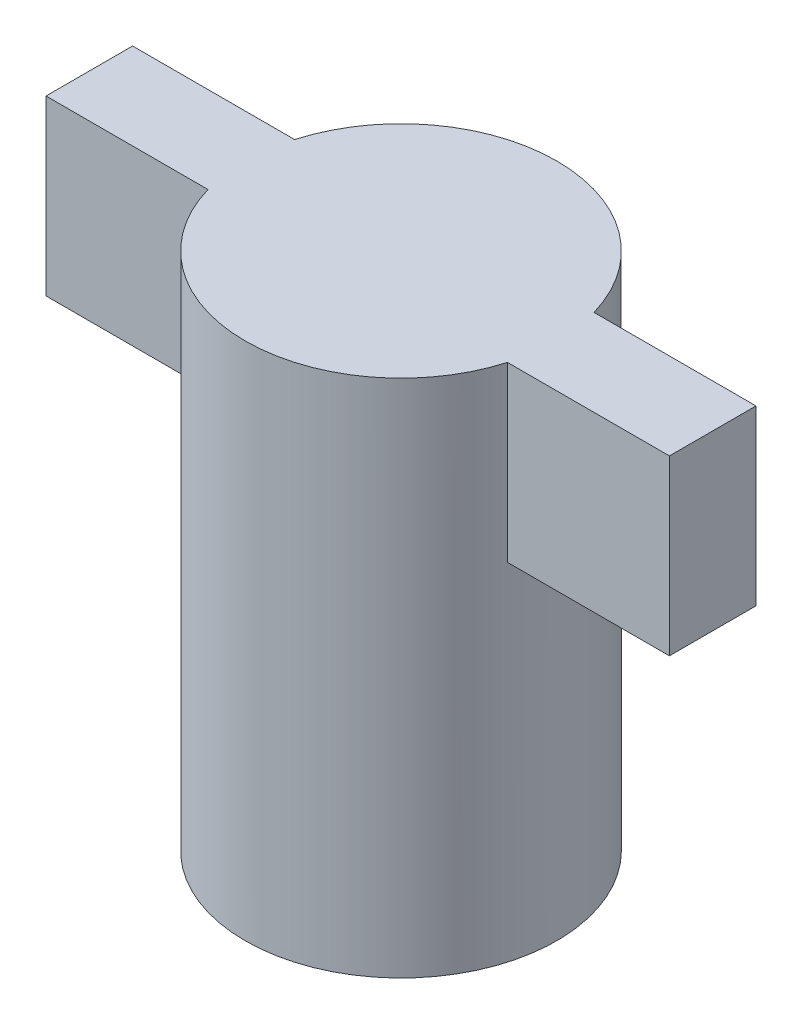
ISO-10303-21;
HEADER;
FILE_DESCRIPTION(('STEP AP214'),'2;1');
FILE_NAME('part.step','',(''),(''),'','','');
FILE_SCHEMA(('AUTOMOTIVE_DESIGN { 1 0 10303 214 1 1 1 1 }'));
ENDSEC;
DATA;
#1=APPLICATION_CONTEXT('core data for automotive mechanical design processes');
#2=APPLICATION_PROTOCOL_DEFINITION('international standard','automotive_design',2000,#1);
#3=PRODUCT_CONTEXT('',#1,'mechanical');
#4=PRODUCT('Part','Part','',(#3));
#5=PRODUCT_RELATED_PRODUCT_CATEGORY('part','',(#4));
#6=PRODUCT_DEFINITION_FORMATION('','',#4);
#7=PRODUCT_DEFINITION_CONTEXT('part definition',#1,'design');
#8=PRODUCT_DEFINITION('design','',#6,#7);
#9=PRODUCT_DEFINITION_SHAPE('','',#8);
#10=(LENGTH_UNIT() NAMED_UNIT(*) SI_UNIT(.MILLI.,.METRE.));
#11=(NAMED_UNIT(*) PLANE_ANGLE_UNIT() SI_UNIT($,.RADIAN.));
#12=(NAMED_UNIT(*) SI_UNIT($,.STERADIAN.) SOLID_ANGLE_UNIT());
#13=UNCERTAINTY_MEASURE_WITH_UNIT(LENGTH_MEASURE(1.E-05),#10,'distance_accuracy_value','');
#14=(GEOMETRIC_REPRESENTATION_CONTEXT(3) GLOBAL_UNCERTAINTY_ASSIGNED_CONTEXT((#13)) GLOBAL_UNIT_ASSIGNED_CONTEXT((#10,
#11,#12)) REPRESENTATION_CONTEXT('',''));
#15=CARTESIAN_POINT('',(0.,0.,0.));
#16=DIRECTION('',(0.,0.,1.));
#17=DIRECTION('',(1.,0.,0.));
#18=AXIS2_PLACEMENT_3D('',#15,#16,#17);
#19=CARTESIAN_POINT('',(0.,15.,0.));
#20=DIRECTION('',(0.,-1.,0.));
#21=DIRECTION('',(0.,0.,-1.));
#22=AXIS2_PLACEMENT_3D('',#19,#20,#21);
#23=CYLINDRICAL_SURFACE('',#22,4.5);
#24=CARTESIAN_POINT('',(0.,10.,0.));
#25=DIRECTION('',(0.,1.,0.));
#26=DIRECTION('',(0.,0.,1.));
#27=AXIS2_PLACEMENT_3D('',#24,#25,#26);
#28=CIRCLE('',#27,4.5);
#29=CARTESIAN_POINT('',(4.32290411644765,10.,1.25));
#30=VERTEX_POINT('',#29);
#31=CARTESIAN_POINT('',(4.32290411644765,10.,-1.25));
#32=VERTEX_POINT('',#31);
#33=EDGE_CURVE('E11',#30,#32,#28,.T.);
#34=ORIENTED_EDGE('',*,*,#33,.F.);
#35=DIRECTION('',(0.,-1.,0.));
#36=VECTOR('',#35,1.);
#37=CARTESIAN_POINT('',(4.32290411644765,15.,1.25));
#38=LINE('',#37,#36);
#39=CARTESIAN_POINT('',(4.32290411644765,15.,1.25));
#40=VERTEX_POINT('',#39);
#41=EDGE_CURVE('E199',#30,#40,#38,.F.);
#42=ORIENTED_EDGE('',*,*,#41,.T.);
#43=CARTESIAN_POINT('',(0.,15.,0.));
#44=DIRECTION('',(0.,1.,0.));
#45=DIRECTION('',(0.,0.,1.));
#46=AXIS2_PLACEMENT_3D('',#43,#44,#45);
#47=CIRCLE('',#46,4.5);
#48=CARTESIAN_POINT('',(-4.32290411644765,15.,1.25));
#49=VERTEX_POINT('',#48);
#50=EDGE_CURVE('E270',#49,#40,#47,.T.);
#51=ORIENTED_EDGE('',*,*,#50,.F.);
#52=DIRECTION('',(0.,-1.,0.));
#53=VECTOR('',#52,1.);
#54=CARTESIAN_POINT('',(-4.32290411644765,15.,1.25));
#55=LINE('',#54,#53);
#56=CARTESIAN_POINT('',(-4.32290411644765,10.,1.25));
#57=VERTEX_POINT('',#56);
#58=EDGE_CURVE('E203',#49,#57,#55,.T.);
#59=ORIENTED_EDGE('',*,*,#58,.T.);
#60=CARTESIAN_POINT('',(-4.32290411644765,10.,-1.25));
#61=VERTEX_POINT('',#60);
#62=EDGE_CURVE('E42',#61,#57,#28,.T.);
#63=ORIENTED_EDGE('',*,*,#62,.F.);
#64=DIRECTION('',(0.,-1.,0.));
#65=VECTOR('',#64,1.);
#66=CARTESIAN_POINT('',(-4.32290411644765,15.,-1.25));
#67=LINE('',#66,#65);
#68=CARTESIAN_POINT('',(-4.32290411644765,15.,-1.25));
#69=VERTEX_POINT('',#68);
#70=EDGE_CURVE('E186',#61,#69,#67,.F.);
#71=ORIENTED_EDGE('',*,*,#70,.T.);
#72=CARTESIAN_POINT('',(4.32290411644765,15.,-1.25));
#73=VERTEX_POINT('',#72);
#74=EDGE_CURVE('E272',#73,#69,#47,.T.);
#75=ORIENTED_EDGE('',*,*,#74,.F.);
#76=DIRECTION('',(0.,-1.,0.));
#77=VECTOR('',#76,1.);
#78=CARTESIAN_POINT('',(4.32290411644765,15.,-1.25));
#79=LINE('',#78,#77);
#80=EDGE_CURVE('E196',#73,#32,#79,.T.);
#81=ORIENTED_EDGE('',*,*,#80,.T.);
#82=EDGE_LOOP('',(#34,#42,#51,#59,#63,#71,#75,#81));
#83=FACE_BOUND('',#82,.T.);
#84=CARTESIAN_POINT('',(0.,0.,0.));
#85=DIRECTION('',(0.,1.,0.));
#86=DIRECTION('',(0.,0.,1.));
#87=AXIS2_PLACEMENT_3D('',#84,#85,#86);
#88=CIRCLE('',#87,4.5);
#89=CARTESIAN_POINT('',(0.,0.,4.5));
#90=VERTEX_POINT('',#89);
#91=EDGE_CURVE('E266',#90,#90,#88,.T.);
#92=ORIENTED_EDGE('',*,*,#91,.T.);
#93=EDGE_LOOP('',(#92));
#94=FACE_BOUND('',#93,.T.);
#95=ADVANCED_FACE('F39',(#83,#94),#23,.T.);
#96=CARTESIAN_POINT('',(0.,15.,0.));
#97=DIRECTION('',(0.,1.,0.));
#98=DIRECTION('',(0.,0.,1.));
#99=AXIS2_PLACEMENT_3D('',#96,#97,#98);
#100=PLANE('',#99);
#101=ORIENTED_EDGE('',*,*,#74,.T.);
#102=DIRECTION('',(-1.,0.,0.));
#103=VECTOR('',#102,1.);
#104=CARTESIAN_POINT('',(-9.,15.,-1.25));
#105=LINE('',#104,#103);
#106=CARTESIAN_POINT('',(-9.,15.,-1.25));
#107=VERTEX_POINT('',#106);
#108=EDGE_CURVE('E178',#69,#107,#105,.T.);
#109=ORIENTED_EDGE('',*,*,#108,.T.);
#110=DIRECTION('',(0.,0.,1.));
#111=VECTOR('',#110,1.);
#112=CARTESIAN_POINT('',(-9.,15.,-1.25));
#113=LINE('',#112,#111);
#114=CARTESIAN_POINT('',(-9.,15.,1.25));
#115=VERTEX_POINT('',#114);
#116=EDGE_CURVE('E181',#107,#115,#113,.T.);
#117=ORIENTED_EDGE('',*,*,#116,.T.);
#118=DIRECTION('',(1.,0.,0.));
#119=VECTOR('',#118,1.);
#120=CARTESIAN_POINT('',(-9.,15.,1.25));
#121=LINE('',#120,#119);
#122=EDGE_CURVE('E54',#115,#49,#121,.T.);
#123=ORIENTED_EDGE('',*,*,#122,.T.);
#124=ORIENTED_EDGE('',*,*,#50,.T.);
#125=CARTESIAN_POINT('',(9.,15.,1.25));
#126=VERTEX_POINT('',#125);
#127=EDGE_CURVE('E165',#40,#126,#121,.T.);
#128=ORIENTED_EDGE('',*,*,#127,.T.);
#129=DIRECTION('',(0.,0.,-1.));
#130=VECTOR('',#129,1.);
#131=CARTESIAN_POINT('',(9.,15.,-1.25));
#132=LINE('',#131,#130);
#133=CARTESIAN_POINT('',(9.,15.,-1.25));
#134=VERTEX_POINT('',#133);
#135=EDGE_CURVE('E175',#126,#134,#132,.T.);
#136=ORIENTED_EDGE('',*,*,#135,.T.);
#137=EDGE_CURVE('E61',#134,#73,#105,.T.);
#138=ORIENTED_EDGE('',*,*,#137,.T.);
#139=EDGE_LOOP('',(#101,#109,#117,#123,#124,#128,#136,#138));
#140=FACE_BOUND('',#139,.T.);
#141=ADVANCED_FACE('F281',(#140),#100,.T.);
#142=CARTESIAN_POINT('',(0.,0.,0.));
#143=DIRECTION('',(0.,1.,0.));
#144=DIRECTION('',(0.,0.,1.));
#145=AXIS2_PLACEMENT_3D('',#142,#143,#144);
#146=PLANE('',#145);
#147=CARTESIAN_POINT('',(0.,0.,0.00920047577960409));
#148=DIRECTION('',(0.,-1.,0.));
#149=DIRECTION('',(0.,0.,-1.));
#150=AXIS2_PLACEMENT_3D('',#147,#148,#149);
#151=CIRCLE('',#150,4.);
#152=CARTESIAN_POINT('',(0.,0.,-3.9907995242204));
#153=VERTEX_POINT('',#152);
#154=EDGE_CURVE('E257',#153,#153,#151,.T.);
#155=ORIENTED_EDGE('',*,*,#154,.F.);
#156=EDGE_LOOP('',(#155));
#157=FACE_BOUND('',#156,.T.);
#158=ORIENTED_EDGE('',*,*,#91,.F.);
#159=EDGE_LOOP('',(#158));
#160=FACE_BOUND('',#159,.T.);
#161=ADVANCED_FACE('F278',(#157,#160),#146,.F.);
#162=CARTESIAN_POINT('',(0.,1.5,0.00920047577960409));
#163=DIRECTION('',(0.,-1.,0.));
#164=DIRECTION('',(0.,0.,-1.));
#165=AXIS2_PLACEMENT_3D('',#162,#163,#164);
#166=CYLINDRICAL_SURFACE('',#165,4.);
#167=CARTESIAN_POINT('',(0.,1.5,0.00920047577960409));
#168=DIRECTION('',(0.,-1.,0.));
#169=DIRECTION('',(0.,0.,-1.));
#170=AXIS2_PLACEMENT_3D('',#167,#168,#169);
#171=CIRCLE('',#170,4.);
#172=CARTESIAN_POINT('',(0.,1.5,-3.9907995242204));
#173=VERTEX_POINT('',#172);
#174=EDGE_CURVE('E262',#173,#173,#171,.T.);
#175=ORIENTED_EDGE('',*,*,#174,.F.);
#176=EDGE_LOOP('',(#175));
#177=FACE_BOUND('',#176,.T.);
#178=ORIENTED_EDGE('',*,*,#154,.T.);
#179=EDGE_LOOP('',(#178));
#180=FACE_BOUND('',#179,.T.);
#181=ADVANCED_FACE('F280',(#177,#180),#166,.F.);
#182=CARTESIAN_POINT('',(0.,1.5,0.00920047577960409));
#183=DIRECTION('',(0.,-1.,0.));
#184=DIRECTION('',(0.,0.,-1.));
#185=AXIS2_PLACEMENT_3D('',#182,#183,#184);
#186=PLANE('',#185);
#187=CARTESIAN_POINT('',(0.00613365051973548,1.5,-0.00920047577960409));
#188=DIRECTION('',(0.,-1.,0.));
#189=DIRECTION('',(0.,0.,-1.));
#190=AXIS2_PLACEMENT_3D('',#187,#188,#189);
#191=CIRCLE('',#190,3.);
#192=CARTESIAN_POINT('',(0.00613365051973548,1.5,-3.0092004757796));
#193=VERTEX_POINT('',#192);
#194=EDGE_CURVE('E243',#193,#193,#191,.T.);
#195=ORIENTED_EDGE('',*,*,#194,.F.);
#196=EDGE_LOOP('',(#195));
#197=FACE_BOUND('',#196,.T.);
#198=ORIENTED_EDGE('',*,*,#174,.T.);
#199=EDGE_LOOP('',(#198));
#200=FACE_BOUND('',#199,.T.);
#201=ADVANCED_FACE('F287',(#197,#200),#186,.T.);
#202=CARTESIAN_POINT('',(0.00613365051973548,4.,-0.00920047577960409));
#203=DIRECTION('',(0.,-1.,0.));
#204=DIRECTION('',(0.,0.,-1.));
#205=AXIS2_PLACEMENT_3D('',#202,#203,#204);
#206=CYLINDRICAL_SURFACE('',#205,3.);
#207=CARTESIAN_POINT('',(0.00613365051973548,4.,-0.00920047577960409));
#208=DIRECTION('',(0.,-1.,0.));
#209=DIRECTION('',(0.,0.,-1.));
#210=AXIS2_PLACEMENT_3D('',#207,#208,#209);
#211=CIRCLE('',#210,3.);
#212=CARTESIAN_POINT('',(-2.43075951008928,4.,1.7405285671802));
#213=VERTEX_POINT('',#212);
#214=CARTESIAN_POINT('',(-2.44461366718219,4.,-1.7394714328198));
#215=VERTEX_POINT('',#214);
#216=EDGE_CURVE('E253',#213,#215,#211,.T.);
#217=ORIENTED_EDGE('',*,*,#216,.F.);
#218=EDGE_CURVE('E258',#215,#213,#211,.T.);
#219=ORIENTED_EDGE('',*,*,#218,.F.);
#220=EDGE_LOOP('',(#217,#219));
#221=FACE_BOUND('',#220,.T.);
#222=ORIENTED_EDGE('',*,*,#194,.T.);
#223=EDGE_LOOP('',(#222));
#224=FACE_BOUND('',#223,.T.);
#225=ADVANCED_FACE('F325',(#221,#224),#206,.F.);
#226=CARTESIAN_POINT('',(0.00613365051973548,4.,-0.00920047577960409));
#227=DIRECTION('',(0.,-1.,0.));
#228=DIRECTION('',(0.,0.,-1.));
#229=AXIS2_PLACEMENT_3D('',#226,#227,#228);
#230=PLANE('',#229);
#231=DIRECTION('',(-1.,0.,0.));
#232=VECTOR('',#231,1.);
#233=CARTESIAN_POINT('',(-2.44618852665088,4.,1.7405285671802));
#234=LINE('',#233,#232);
#235=CARTESIAN_POINT('',(2.44151031840903,4.,1.7405285671802));
#236=VERTEX_POINT('',#235);
#237=EDGE_CURVE('E228',#236,#213,#234,.T.);
#238=ORIENTED_EDGE('',*,*,#237,.F.);
#239=CARTESIAN_POINT('',(-0.00233910412092181,4.,0.000528567180196979));
#240=DIRECTION('',(0.,-1.,0.));
#241=DIRECTION('',(0.,0.,1.));
#242=AXIS2_PLACEMENT_3D('',#239,#240,#241);
#243=CIRCLE('',#242,3.);
#244=CARTESIAN_POINT('',(2.44151031840904,4.,-1.7394714328198));
#245=VERTEX_POINT('',#244);
#246=EDGE_CURVE('E207',#245,#236,#243,.T.);
#247=ORIENTED_EDGE('',*,*,#246,.F.);
#248=DIRECTION('',(1.,0.,0.));
#249=VECTOR('',#248,1.);
#250=CARTESIAN_POINT('',(-2.44618852665088,4.,-1.7394714328198));
#251=LINE('',#250,#249);
#252=EDGE_CURVE('E238',#215,#245,#251,.T.);
#253=ORIENTED_EDGE('',*,*,#252,.F.);
#254=ORIENTED_EDGE('',*,*,#218,.T.);
#255=EDGE_LOOP('',(#238,#247,#253,#254));
#256=FACE_BOUND('',#255,.T.);
#257=ADVANCED_FACE('F322',(#256),#230,.T.);
#258=CARTESIAN_POINT('',(-0.00233910412092181,4.,0.000528567180196979));
#259=DIRECTION('',(0.,1.,0.));
#260=DIRECTION('',(0.,0.,1.));
#261=AXIS2_PLACEMENT_3D('',#258,#259,#260);
#262=PLANE('',#261);
#263=ORIENTED_EDGE('',*,*,#216,.T.);
#264=CARTESIAN_POINT('',(-2.44618852665088,4.,-1.7394714328198));
#265=VERTEX_POINT('',#264);
#266=EDGE_CURVE('E212',#265,#215,#251,.T.);
#267=ORIENTED_EDGE('',*,*,#266,.F.);
#268=CARTESIAN_POINT('',(-0.00233910412092181,4.,0.000528567180196979));
#269=DIRECTION('',(0.,-1.,0.));
#270=DIRECTION('',(0.,0.,-1.));
#271=AXIS2_PLACEMENT_3D('',#268,#269,#270);
#272=CIRCLE('',#271,3.);
#273=CARTESIAN_POINT('',(-2.44618852665088,4.,1.7405285671802));
#274=VERTEX_POINT('',#273);
#275=EDGE_CURVE('E232',#274,#265,#272,.T.);
#276=ORIENTED_EDGE('',*,*,#275,.F.);
#277=EDGE_CURVE('E227',#213,#274,#234,.T.);
#278=ORIENTED_EDGE('',*,*,#277,.F.);
#279=EDGE_LOOP('',(#263,#267,#276,#278));
#280=FACE_BOUND('',#279,.T.);
#281=ADVANCED_FACE('F329',(#280),#262,.T.);
#282=CARTESIAN_POINT('',(-0.00233910412092181,10.,0.000528567180196979));
#283=DIRECTION('',(0.,-1.,0.));
#284=DIRECTION('',(0.,0.,-1.));
#285=AXIS2_PLACEMENT_3D('',#282,#283,#284);
#286=CYLINDRICAL_SURFACE('',#285,3.);
#287=ORIENTED_EDGE('',*,*,#246,.T.);
#288=DIRECTION('',(0.,-1.,0.));
#289=VECTOR('',#288,1.);
#290=CARTESIAN_POINT('',(2.44151031840903,10.,1.7405285671802));
#291=LINE('',#290,#289);
#292=CARTESIAN_POINT('',(2.44151031840903,10.,1.7405285671802));
#293=VERTEX_POINT('',#292);
#294=EDGE_CURVE('E223',#293,#236,#291,.T.);
#295=ORIENTED_EDGE('',*,*,#294,.F.);
#296=CARTESIAN_POINT('',(-0.00233910412092181,10.,0.000528567180196979));
#297=DIRECTION('',(0.,-1.,0.));
#298=DIRECTION('',(0.,0.,1.));
#299=AXIS2_PLACEMENT_3D('',#296,#297,#298);
#300=CIRCLE('',#299,3.);
#301=CARTESIAN_POINT('',(2.44151031840904,10.,-1.7394714328198));
#302=VERTEX_POINT('',#301);
#303=EDGE_CURVE('E208',#302,#293,#300,.T.);
#304=ORIENTED_EDGE('',*,*,#303,.F.);
#305=DIRECTION('',(0.,-1.,0.));
#306=VECTOR('',#305,1.);
#307=CARTESIAN_POINT('',(2.44151031840904,10.,-1.7394714328198));
#308=LINE('',#307,#306);
#309=EDGE_CURVE('E239',#302,#245,#308,.T.);
#310=ORIENTED_EDGE('',*,*,#309,.T.);
#311=EDGE_LOOP('',(#287,#295,#304,#310));
#312=FACE_BOUND('',#311,.T.);
#313=ADVANCED_FACE('F337',(#312),#286,.F.);
#314=CARTESIAN_POINT('',(-2.44618852665088,10.,-1.7394714328198));
#315=DIRECTION('',(0.,0.,-1.));
#316=DIRECTION('',(-1.,0.,0.));
#317=AXIS2_PLACEMENT_3D('',#314,#315,#316);
#318=PLANE('',#317);
#319=ORIENTED_EDGE('',*,*,#266,.T.);
#320=ORIENTED_EDGE('',*,*,#252,.T.);
#321=ORIENTED_EDGE('',*,*,#309,.F.);
#322=DIRECTION('',(1.,0.,0.));
#323=VECTOR('',#322,1.);
#324=CARTESIAN_POINT('',(-2.44618852665088,10.,-1.7394714328198));
#325=LINE('',#324,#323);
#326=CARTESIAN_POINT('',(-2.44618852665088,10.,-1.7394714328198));
#327=VERTEX_POINT('',#326);
#328=EDGE_CURVE('E219',#327,#302,#325,.T.);
#329=ORIENTED_EDGE('',*,*,#328,.F.);
#330=DIRECTION('',(0.,-1.,0.));
#331=VECTOR('',#330,1.);
#332=CARTESIAN_POINT('',(-2.44618852665088,10.,-1.7394714328198));
#333=LINE('',#332,#331);
#334=EDGE_CURVE('E244',#327,#265,#333,.T.);
#335=ORIENTED_EDGE('',*,*,#334,.T.);
#336=EDGE_LOOP('',(#319,#320,#321,#329,#335));
#337=FACE_BOUND('',#336,.T.);
#338=ADVANCED_FACE('F339',(#337),#318,.F.);
#339=CARTESIAN_POINT('',(-0.00233910412092181,10.,0.000528567180196979));
#340=DIRECTION('',(0.,-1.,0.));
#341=DIRECTION('',(0.,0.,-1.));
#342=AXIS2_PLACEMENT_3D('',#339,#340,#341);
#343=CYLINDRICAL_SURFACE('',#342,3.);
#344=ORIENTED_EDGE('',*,*,#275,.T.);
#345=ORIENTED_EDGE('',*,*,#334,.F.);
#346=CARTESIAN_POINT('',(-0.00233910412092181,10.,0.000528567180196979));
#347=DIRECTION('',(0.,-1.,0.));
#348=DIRECTION('',(0.,0.,-1.));
#349=AXIS2_PLACEMENT_3D('',#346,#347,#348);
#350=CIRCLE('',#349,3.);
#351=CARTESIAN_POINT('',(-2.44618852665088,10.,1.7405285671802));
#352=VERTEX_POINT('',#351);
#353=EDGE_CURVE('E216',#352,#327,#350,.T.);
#354=ORIENTED_EDGE('',*,*,#353,.F.);
#355=DIRECTION('',(0.,-1.,0.));
#356=VECTOR('',#355,1.);
#357=CARTESIAN_POINT('',(-2.44618852665088,10.,1.7405285671802));
#358=LINE('',#357,#356);
#359=EDGE_CURVE('E247',#352,#274,#358,.T.);
#360=ORIENTED_EDGE('',*,*,#359,.T.);
#361=EDGE_LOOP('',(#344,#345,#354,#360));
#362=FACE_BOUND('',#361,.T.);
#363=ADVANCED_FACE('F345',(#362),#343,.F.);
#364=CARTESIAN_POINT('',(-2.44618852665088,10.,1.7405285671802));
#365=DIRECTION('',(0.,0.,1.));
#366=DIRECTION('',(1.,0.,0.));
#367=AXIS2_PLACEMENT_3D('',#364,#365,#366);
#368=PLANE('',#367);
#369=ORIENTED_EDGE('',*,*,#237,.T.);
#370=ORIENTED_EDGE('',*,*,#277,.T.);
#371=ORIENTED_EDGE('',*,*,#359,.F.);
#372=DIRECTION('',(-1.,0.,0.));
#373=VECTOR('',#372,1.);
#374=CARTESIAN_POINT('',(-2.44618852665088,10.,1.7405285671802));
#375=LINE('',#374,#373);
#376=EDGE_CURVE('E211',#293,#352,#375,.T.);
#377=ORIENTED_EDGE('',*,*,#376,.F.);
#378=ORIENTED_EDGE('',*,*,#294,.T.);
#379=EDGE_LOOP('',(#369,#370,#371,#377,#378));
#380=FACE_BOUND('',#379,.T.);
#381=ADVANCED_FACE('F332',(#380),#368,.F.);
#382=CARTESIAN_POINT('',(-0.00233910412092181,10.,0.000528567180196979));
#383=DIRECTION('',(0.,1.,0.));
#384=DIRECTION('',(0.,0.,1.));
#385=AXIS2_PLACEMENT_3D('',#382,#383,#384);
#386=PLANE('',#385);
#387=ORIENTED_EDGE('',*,*,#303,.T.);
#388=ORIENTED_EDGE('',*,*,#376,.T.);
#389=ORIENTED_EDGE('',*,*,#353,.T.);
#390=ORIENTED_EDGE('',*,*,#328,.T.);
#391=EDGE_LOOP('',(#387,#388,#389,#390));
#392=FACE_BOUND('',#391,.T.);
#393=ADVANCED_FACE('F342',(#392),#386,.F.);
#394=CARTESIAN_POINT('',(-9.,10.,-1.25));
#395=DIRECTION('',(-1.,0.,0.));
#396=DIRECTION('',(0.,0.,1.));
#397=AXIS2_PLACEMENT_3D('',#394,#395,#396);
#398=PLANE('',#397);
#399=ORIENTED_EDGE('',*,*,#116,.F.);
#400=DIRECTION('',(0.,1.,0.));
#401=VECTOR('',#400,1.);
#402=CARTESIAN_POINT('',(-9.,10.,-1.25));
#403=LINE('',#402,#401);
#404=CARTESIAN_POINT('',(-9.,10.,-1.25));
#405=VERTEX_POINT('',#404);
#406=EDGE_CURVE('E144',#405,#107,#403,.T.);
#407=ORIENTED_EDGE('',*,*,#406,.F.);
#408=DIRECTION('',(0.,0.,1.));
#409=VECTOR('',#408,1.);
#410=CARTESIAN_POINT('',(-9.,10.,-1.25));
#411=LINE('',#410,#409);
#412=CARTESIAN_POINT('',(-9.,10.,1.25));
#413=VERTEX_POINT('',#412);
#414=EDGE_CURVE('E154',#405,#413,#411,.T.);
#415=ORIENTED_EDGE('',*,*,#414,.T.);
#416=DIRECTION('',(0.,1.,0.));
#417=VECTOR('',#416,1.);
#418=CARTESIAN_POINT('',(-9.,10.,1.25));
#419=LINE('',#418,#417);
#420=EDGE_CURVE('E187',#413,#115,#419,.T.);
#421=ORIENTED_EDGE('',*,*,#420,.T.);
#422=EDGE_LOOP('',(#399,#407,#415,#421));
#423=FACE_BOUND('',#422,.T.);
#424=ADVANCED_FACE('F424',(#423),#398,.T.);
#425=CARTESIAN_POINT('',(0.,10.,0.));
#426=DIRECTION('',(0.,1.,0.));
#427=DIRECTION('',(0.,0.,1.));
#428=AXIS2_PLACEMENT_3D('',#425,#426,#427);
#429=PLANE('',#428);
#430=DIRECTION('',(-1.,0.,0.));
#431=VECTOR('',#430,1.);
#432=CARTESIAN_POINT('',(-9.,10.,-1.25));
#433=LINE('',#432,#431);
#434=EDGE_CURVE('E155',#61,#405,#433,.T.);
#435=ORIENTED_EDGE('',*,*,#434,.F.);
#436=ORIENTED_EDGE('',*,*,#62,.T.);
#437=DIRECTION('',(1.,0.,0.));
#438=VECTOR('',#437,1.);
#439=CARTESIAN_POINT('',(-9.,10.,1.25));
#440=LINE('',#439,#438);
#441=EDGE_CURVE('E145',#413,#57,#440,.T.);
#442=ORIENTED_EDGE('',*,*,#441,.F.);
#443=ORIENTED_EDGE('',*,*,#414,.F.);
#444=EDGE_LOOP('',(#435,#436,#442,#443));
#445=FACE_BOUND('',#444,.T.);
#446=ADVANCED_FACE('F307',(#445),#429,.F.);
#447=CARTESIAN_POINT('',(-9.,10.,-1.25));
#448=DIRECTION('',(0.,0.,-1.));
#449=DIRECTION('',(-1.,0.,0.));
#450=AXIS2_PLACEMENT_3D('',#447,#448,#449);
#451=PLANE('',#450);
#452=ORIENTED_EDGE('',*,*,#70,.F.);
#453=ORIENTED_EDGE('',*,*,#434,.T.);
#454=ORIENTED_EDGE('',*,*,#406,.T.);
#455=ORIENTED_EDGE('',*,*,#108,.F.);
#456=EDGE_LOOP('',(#452,#453,#454,#455));
#457=FACE_BOUND('',#456,.T.);
#458=ADVANCED_FACE('F438',(#457),#451,.T.);
#459=CARTESIAN_POINT('',(-9.,10.,1.25));
#460=DIRECTION('',(0.,0.,1.));
#461=DIRECTION('',(1.,0.,0.));
#462=AXIS2_PLACEMENT_3D('',#459,#460,#461);
#463=PLANE('',#462);
#464=ORIENTED_EDGE('',*,*,#58,.F.);
#465=ORIENTED_EDGE('',*,*,#122,.F.);
#466=ORIENTED_EDGE('',*,*,#420,.F.);
#467=ORIENTED_EDGE('',*,*,#441,.T.);
#468=EDGE_LOOP('',(#464,#465,#466,#467));
#469=FACE_BOUND('',#468,.T.);
#470=ADVANCED_FACE('F310',(#469),#463,.T.);
#471=CARTESIAN_POINT('',(9.,10.,1.25));
#472=VERTEX_POINT('',#471);
#473=EDGE_CURVE('E171',#30,#472,#440,.T.);
#474=ORIENTED_EDGE('',*,*,#473,.F.);
#475=ORIENTED_EDGE('',*,*,#33,.T.);
#476=CARTESIAN_POINT('',(9.,10.,-1.25));
#477=VERTEX_POINT('',#476);
#478=EDGE_CURVE('E138',#477,#32,#433,.T.);
#479=ORIENTED_EDGE('',*,*,#478,.F.);
#480=DIRECTION('',(0.,0.,-1.));
#481=VECTOR('',#480,1.);
#482=CARTESIAN_POINT('',(9.,10.,-1.25));
#483=LINE('',#482,#481);
#484=EDGE_CURVE('E151',#472,#477,#483,.T.);
#485=ORIENTED_EDGE('',*,*,#484,.F.);
#486=EDGE_LOOP('',(#474,#475,#479,#485));
#487=FACE_BOUND('',#486,.T.);
#488=ADVANCED_FACE('F150',(#487),#429,.F.);
#489=ORIENTED_EDGE('',*,*,#41,.F.);
#490=ORIENTED_EDGE('',*,*,#473,.T.);
#491=DIRECTION('',(0.,1.,0.));
#492=VECTOR('',#491,1.);
#493=CARTESIAN_POINT('',(9.,10.,1.25));
#494=LINE('',#493,#492);
#495=EDGE_CURVE('E160',#472,#126,#494,.T.);
#496=ORIENTED_EDGE('',*,*,#495,.T.);
#497=ORIENTED_EDGE('',*,*,#127,.F.);
#498=EDGE_LOOP('',(#489,#490,#496,#497));
#499=FACE_BOUND('',#498,.T.);
#500=ADVANCED_FACE('F313',(#499),#463,.T.);
#501=ORIENTED_EDGE('',*,*,#80,.F.);
#502=ORIENTED_EDGE('',*,*,#137,.F.);
#503=DIRECTION('',(0.,1.,0.));
#504=VECTOR('',#503,1.);
#505=CARTESIAN_POINT('',(9.,10.,-1.25));
#506=LINE('',#505,#504);
#507=EDGE_CURVE('E135',#477,#134,#506,.T.);
#508=ORIENTED_EDGE('',*,*,#507,.F.);
#509=ORIENTED_EDGE('',*,*,#478,.T.);
#510=EDGE_LOOP('',(#501,#502,#508,#509));
#511=FACE_BOUND('',#510,.T.);
#512=ADVANCED_FACE('F137',(#511),#451,.T.);
#513=CARTESIAN_POINT('',(9.,10.,-1.25));
#514=DIRECTION('',(1.,0.,0.));
#515=DIRECTION('',(0.,0.,-1.));
#516=AXIS2_PLACEMENT_3D('',#513,#514,#515);
#517=PLANE('',#516);
#518=ORIENTED_EDGE('',*,*,#135,.F.);
#519=ORIENTED_EDGE('',*,*,#495,.F.);
#520=ORIENTED_EDGE('',*,*,#484,.T.);
#521=ORIENTED_EDGE('',*,*,#507,.T.);
#522=EDGE_LOOP('',(#518,#519,#520,#521));
#523=FACE_BOUND('',#522,.T.);
#524=ADVANCED_FACE('F158',(#523),#517,.T.);
#525=CLOSED_SHELL('',(#95,#141,#161,#181,#201,#225,#257,#281,#313,#338,#363,#381,#393,#424,#446,
#458,#470,#488,#500,#512,#524));
#526=MANIFOLD_SOLID_BREP('B2',#525);
#527=ADVANCED_BREP_SHAPE_REPRESENTATION('',(#18,#526),#14);
#528=SHAPE_DEFINITION_REPRESENTATION(#9,#527);
ENDSEC;
END-ISO-10303-21;
